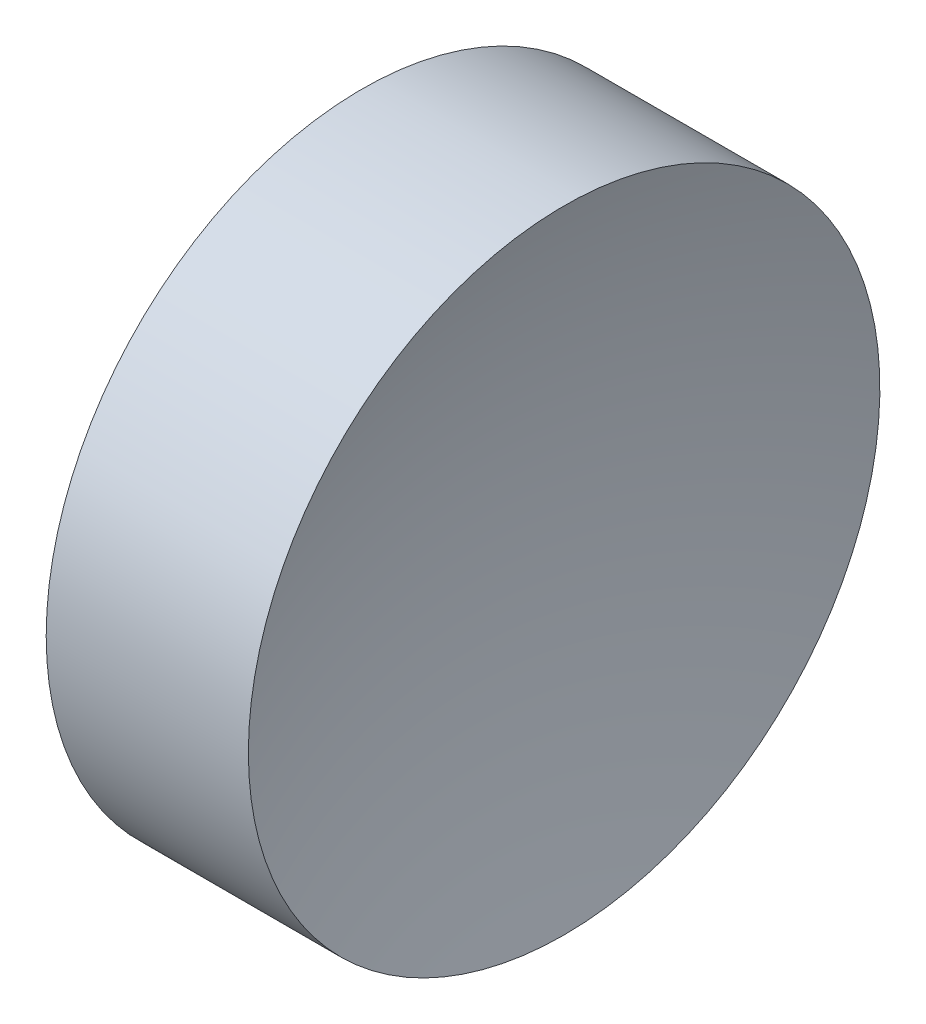
ISO-10303-21;
HEADER;
FILE_DESCRIPTION(('STEP AP214'),'2;1');
FILE_NAME('part.step','',(''),(''),'','','');
FILE_SCHEMA(('AUTOMOTIVE_DESIGN { 1 0 10303 214 1 1 1 1 }'));
ENDSEC;
DATA;
#1=APPLICATION_CONTEXT('core data for automotive mechanical design processes');
#2=APPLICATION_PROTOCOL_DEFINITION('international standard','automotive_design',2000,#1);
#3=PRODUCT_CONTEXT('',#1,'mechanical');
#4=PRODUCT('Part','Part','',(#3));
#5=PRODUCT_RELATED_PRODUCT_CATEGORY('part','',(#4));
#6=PRODUCT_DEFINITION_FORMATION('','',#4);
#7=PRODUCT_DEFINITION_CONTEXT('part definition',#1,'design');
#8=PRODUCT_DEFINITION('design','',#6,#7);
#9=PRODUCT_DEFINITION_SHAPE('','',#8);
#10=(LENGTH_UNIT() NAMED_UNIT(*) SI_UNIT(.MILLI.,.METRE.));
#11=(NAMED_UNIT(*) PLANE_ANGLE_UNIT() SI_UNIT($,.RADIAN.));
#12=(NAMED_UNIT(*) SI_UNIT($,.STERADIAN.) SOLID_ANGLE_UNIT());
#13=UNCERTAINTY_MEASURE_WITH_UNIT(LENGTH_MEASURE(1.E-05),#10,'distance_accuracy_value','');
#14=(GEOMETRIC_REPRESENTATION_CONTEXT(3) GLOBAL_UNCERTAINTY_ASSIGNED_CONTEXT((#13)) GLOBAL_UNIT_ASSIGNED_CONTEXT((#10,
#11,#12)) REPRESENTATION_CONTEXT('',''));
#15=CARTESIAN_POINT('',(0.,0.,0.));
#16=DIRECTION('',(0.,0.,1.));
#17=DIRECTION('',(1.,0.,0.));
#18=AXIS2_PLACEMENT_3D('',#15,#16,#17);
#19=CARTESIAN_POINT('',(80.5463277564655,34.6890105616862,0.));
#20=DIRECTION('',(-1.,0.,0.));
#21=DIRECTION('',(0.,-1.,0.));
#22=AXIS2_PLACEMENT_3D('',#19,#20,#21);
#23=SPHERICAL_SURFACE('',#22,20.);
#24=CARTESIAN_POINT('',(61.5479725645022,34.6890105616862,0.));
#25=DIRECTION('',(-1.,0.,0.));
#26=DIRECTION('',(0.,0.,1.));
#27=AXIS2_PLACEMENT_3D('',#24,#25,#26);
#28=CIRCLE('',#27,6.25000000000001);
#29=CARTESIAN_POINT('',(61.5479725645022,34.6890105616862,6.25000000000001));
#30=VERTEX_POINT('',#29);
#31=EDGE_CURVE('E10',#30,#30,#28,.T.);
#32=ORIENTED_EDGE('',*,*,#31,.F.);
#33=EDGE_LOOP('',(#32));
#34=FACE_BOUND('',#33,.T.);
#35=ADVANCED_FACE('F35',(#34),#23,.F.);
#36=CARTESIAN_POINT('',(54.4925715010826,34.6890105616862,0.));
#37=DIRECTION('',(-1.,0.,0.));
#38=DIRECTION('',(0.,0.,1.));
#39=AXIS2_PLACEMENT_3D('',#36,#37,#38);
#40=CYLINDRICAL_SURFACE('',#39,6.25);
#41=CARTESIAN_POINT('',(57.5463277674598,34.6890105616862,0.));
#42=DIRECTION('',(-1.,0.,0.));
#43=DIRECTION('',(0.,0.,1.));
#44=AXIS2_PLACEMENT_3D('',#41,#42,#43);
#45=CIRCLE('',#44,6.25);
#46=CARTESIAN_POINT('',(57.5463277674598,34.6890105616862,6.25));
#47=VERTEX_POINT('',#46);
#48=EDGE_CURVE('E41',#47,#47,#45,.T.);
#49=ORIENTED_EDGE('',*,*,#48,.F.);
#50=EDGE_LOOP('',(#49));
#51=FACE_BOUND('',#50,.T.);
#52=ORIENTED_EDGE('',*,*,#31,.T.);
#53=EDGE_LOOP('',(#52));
#54=FACE_BOUND('',#53,.T.);
#55=ADVANCED_FACE('F49',(#51,#54),#40,.T.);
#56=CARTESIAN_POINT('',(57.5463277674598,34.6890105616862,0.));
#57=DIRECTION('',(1.,0.,0.));
#58=DIRECTION('',(0.,0.,-1.));
#59=AXIS2_PLACEMENT_3D('',#56,#57,#58);
#60=PLANE('',#59);
#61=ORIENTED_EDGE('',*,*,#48,.T.);
#62=EDGE_LOOP('',(#61));
#63=FACE_BOUND('',#62,.T.);
#64=ADVANCED_FACE('F47',(#63),#60,.F.);
#65=CLOSED_SHELL('',(#35,#55,#64));
#66=MANIFOLD_SOLID_BREP('B2',#65);
#67=ADVANCED_BREP_SHAPE_REPRESENTATION('',(#18,#66),#14);
#68=SHAPE_DEFINITION_REPRESENTATION(#9,#67);
ENDSEC;
END-ISO-10303-21;
